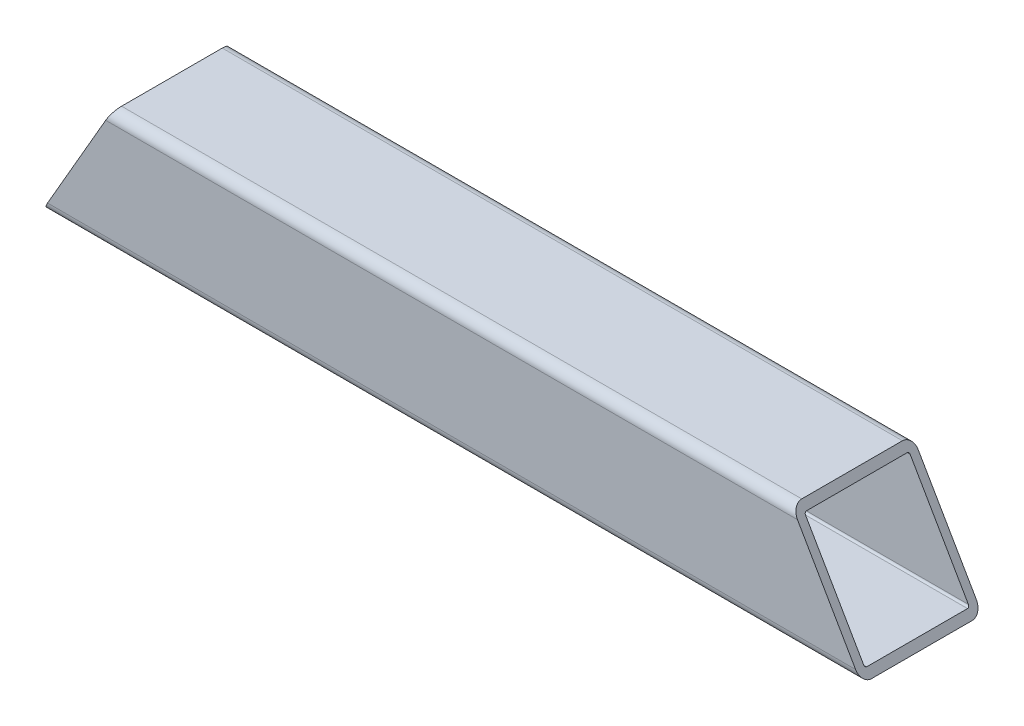
ISO-10303-21;
HEADER;
FILE_DESCRIPTION(('STEP AP214'),'2;1');
FILE_NAME('part.step','',(''),(''),'','','');
FILE_SCHEMA(('AUTOMOTIVE_DESIGN { 1 0 10303 214 1 1 1 1 }'));
ENDSEC;
DATA;
#1=APPLICATION_CONTEXT('core data for automotive mechanical design processes');
#2=APPLICATION_PROTOCOL_DEFINITION('international standard','automotive_design',2000,#1);
#3=PRODUCT_CONTEXT('',#1,'mechanical');
#4=PRODUCT('Part','Part','',(#3));
#5=PRODUCT_RELATED_PRODUCT_CATEGORY('part','',(#4));
#6=PRODUCT_DEFINITION_FORMATION('','',#4);
#7=PRODUCT_DEFINITION_CONTEXT('part definition',#1,'design');
#8=PRODUCT_DEFINITION('design','',#6,#7);
#9=PRODUCT_DEFINITION_SHAPE('','',#8);
#10=(LENGTH_UNIT() NAMED_UNIT(*) SI_UNIT(.MILLI.,.METRE.));
#11=(NAMED_UNIT(*) PLANE_ANGLE_UNIT() SI_UNIT($,.RADIAN.));
#12=(NAMED_UNIT(*) SI_UNIT($,.STERADIAN.) SOLID_ANGLE_UNIT());
#13=UNCERTAINTY_MEASURE_WITH_UNIT(LENGTH_MEASURE(1.E-05),#10,'distance_accuracy_value','');
#14=(GEOMETRIC_REPRESENTATION_CONTEXT(3) GLOBAL_UNCERTAINTY_ASSIGNED_CONTEXT((#13)) GLOBAL_UNIT_ASSIGNED_CONTEXT((#10,
#11,#12)) REPRESENTATION_CONTEXT('',''));
#15=CARTESIAN_POINT('',(0.,0.,0.));
#16=DIRECTION('',(0.,0.,1.));
#17=DIRECTION('',(1.,0.,0.));
#18=AXIS2_PLACEMENT_3D('',#15,#16,#17);
#19=CARTESIAN_POINT('',(129.2225,-15.875,15.875));
#20=DIRECTION('',(-1.,0.,0.));
#21=DIRECTION('',(0.,0.,1.));
#22=AXIS2_PLACEMENT_3D('',#19,#20,#21);
#23=CYLINDRICAL_SURFACE('',#22,3.175);
#24=DIRECTION('',(-1.,0.,0.));
#25=VECTOR('',#24,1.);
#26=CARTESIAN_POINT('',(129.2225,-19.05,15.875));
#27=LINE('',#26,#25);
#28=CARTESIAN_POINT('',(129.2225,-19.05,15.875));
#29=VERTEX_POINT('',#28);
#30=CARTESIAN_POINT('',(-129.2225,-19.05,15.875));
#31=VERTEX_POINT('',#30);
#32=EDGE_CURVE('E88',#29,#31,#27,.T.);
#33=ORIENTED_EDGE('',*,*,#32,.F.);
#34=CARTESIAN_POINT('',(127.389412895323,-15.875,15.875));
#35=DIRECTION('',(-0.866025403784442,-0.499999999999995,0.));
#36=DIRECTION('',(-0.499999999999995,0.866025403784442,0.));
#37=AXIS2_PLACEMENT_3D('',#34,#35,#36);
#38=ELLIPSE('',#37,3.66617420935411,3.175);
#39=CARTESIAN_POINT('',(127.389412895323,-15.875,19.05));
#40=VERTEX_POINT('',#39);
#41=EDGE_CURVE('E216',#29,#40,#38,.T.);
#42=ORIENTED_EDGE('',*,*,#41,.T.);
#43=DIRECTION('',(-1.,0.,0.));
#44=VECTOR('',#43,1.);
#45=CARTESIAN_POINT('',(129.2225,-15.875,19.05));
#46=LINE('',#45,#44);
#47=CARTESIAN_POINT('',(-127.389412895323,-15.875,19.05));
#48=VERTEX_POINT('',#47);
#49=EDGE_CURVE('E217',#40,#48,#46,.T.);
#50=ORIENTED_EDGE('',*,*,#49,.T.);
#51=CARTESIAN_POINT('',(-127.389412895323,-15.875,15.875));
#52=DIRECTION('',(-0.866025403784442,0.499999999999995,0.));
#53=DIRECTION('',(-0.499999999999995,-0.866025403784442,0.));
#54=AXIS2_PLACEMENT_3D('',#51,#52,#53);
#55=ELLIPSE('',#54,3.66617420935411,3.175);
#56=EDGE_CURVE('E239',#31,#48,#55,.T.);
#57=ORIENTED_EDGE('',*,*,#56,.F.);
#58=EDGE_LOOP('',(#33,#42,#50,#57));
#59=FACE_BOUND('',#58,.T.);
#60=ADVANCED_FACE('F81',(#59),#23,.T.);
#61=CARTESIAN_POINT('',(129.2225,-15.875,-15.875));
#62=DIRECTION('',(-1.,0.,0.));
#63=DIRECTION('',(0.,0.,1.));
#64=AXIS2_PLACEMENT_3D('',#61,#62,#63);
#65=CYLINDRICAL_SURFACE('',#64,3.175);
#66=DIRECTION('',(-1.,0.,0.));
#67=VECTOR('',#66,1.);
#68=CARTESIAN_POINT('',(129.2225,-15.875,-19.05));
#69=LINE('',#68,#67);
#70=CARTESIAN_POINT('',(127.389412895323,-15.875,-19.05));
#71=VERTEX_POINT('',#70);
#72=CARTESIAN_POINT('',(-127.389412895323,-15.875,-19.05));
#73=VERTEX_POINT('',#72);
#74=EDGE_CURVE('E205',#71,#73,#69,.T.);
#75=ORIENTED_EDGE('',*,*,#74,.F.);
#76=CARTESIAN_POINT('',(127.389412895323,-15.875,-15.875));
#77=DIRECTION('',(-0.866025403784442,-0.499999999999995,0.));
#78=DIRECTION('',(-0.499999999999995,0.866025403784442,0.));
#79=AXIS2_PLACEMENT_3D('',#76,#77,#78);
#80=ELLIPSE('',#79,3.66617420935411,3.175);
#81=CARTESIAN_POINT('',(129.2225,-19.05,-15.875));
#82=VERTEX_POINT('',#81);
#83=EDGE_CURVE('E208',#71,#82,#80,.T.);
#84=ORIENTED_EDGE('',*,*,#83,.T.);
#85=DIRECTION('',(-1.,0.,0.));
#86=VECTOR('',#85,1.);
#87=CARTESIAN_POINT('',(129.2225,-19.05,-15.875));
#88=LINE('',#87,#86);
#89=CARTESIAN_POINT('',(-129.2225,-19.05,-15.875));
#90=VERTEX_POINT('',#89);
#91=EDGE_CURVE('E193',#82,#90,#88,.T.);
#92=ORIENTED_EDGE('',*,*,#91,.T.);
#93=CARTESIAN_POINT('',(-127.389412895323,-15.875,-15.875));
#94=DIRECTION('',(-0.866025403784442,0.499999999999995,0.));
#95=DIRECTION('',(-0.499999999999995,-0.866025403784442,0.));
#96=AXIS2_PLACEMENT_3D('',#93,#94,#95);
#97=ELLIPSE('',#96,3.66617420935411,3.175);
#98=EDGE_CURVE('E240',#73,#90,#97,.T.);
#99=ORIENTED_EDGE('',*,*,#98,.F.);
#100=EDGE_LOOP('',(#75,#84,#92,#99));
#101=FACE_BOUND('',#100,.T.);
#102=ADVANCED_FACE('F209',(#101),#65,.T.);
#103=CARTESIAN_POINT('',(129.2225,15.875,-19.05));
#104=DIRECTION('',(0.,0.,1.));
#105=DIRECTION('',(0.,-1.,0.));
#106=AXIS2_PLACEMENT_3D('',#103,#104,#105);
#107=PLANE('',#106);
#108=DIRECTION('',(-1.,0.,0.));
#109=VECTOR('',#108,1.);
#110=CARTESIAN_POINT('',(129.2225,15.875,-19.05));
#111=LINE('',#110,#109);
#112=CARTESIAN_POINT('',(109.058541848553,15.875,-19.05));
#113=VERTEX_POINT('',#112);
#114=CARTESIAN_POINT('',(-109.058541848553,15.875,-19.05));
#115=VERTEX_POINT('',#114);
#116=EDGE_CURVE('E231',#113,#115,#111,.T.);
#117=ORIENTED_EDGE('',*,*,#116,.F.);
#118=DIRECTION('',(0.499999999999995,-0.866025403784442,0.));
#119=VECTOR('',#118,1.);
#120=CARTESIAN_POINT('',(114.099531386414,7.14375000000017,-19.05));
#121=LINE('',#120,#119);
#122=EDGE_CURVE('E95',#113,#71,#121,.T.);
#123=ORIENTED_EDGE('',*,*,#122,.T.);
#124=ORIENTED_EDGE('',*,*,#74,.T.);
#125=DIRECTION('',(-0.499999999999995,-0.866025403784442,0.));
#126=VECTOR('',#125,1.);
#127=CARTESIAN_POINT('',(-49.4882813864157,119.053717740534,-19.05));
#128=LINE('',#127,#126);
#129=EDGE_CURVE('E243',#115,#73,#128,.T.);
#130=ORIENTED_EDGE('',*,*,#129,.F.);
#131=EDGE_LOOP('',(#117,#123,#124,#130));
#132=FACE_BOUND('',#131,.T.);
#133=ADVANCED_FACE('F298',(#132),#107,.F.);
#134=CARTESIAN_POINT('',(129.2225,15.875,-15.875));
#135=DIRECTION('',(-1.,0.,0.));
#136=DIRECTION('',(0.,0.,1.));
#137=AXIS2_PLACEMENT_3D('',#134,#135,#136);
#138=CYLINDRICAL_SURFACE('',#137,3.175);
#139=DIRECTION('',(-1.,0.,0.));
#140=VECTOR('',#139,1.);
#141=CARTESIAN_POINT('',(129.2225,19.05,-15.875));
#142=LINE('',#141,#140);
#143=CARTESIAN_POINT('',(107.225454743876,19.05,-15.875));
#144=VERTEX_POINT('',#143);
#145=CARTESIAN_POINT('',(-107.225454743876,19.05,-15.875));
#146=VERTEX_POINT('',#145);
#147=EDGE_CURVE('E229',#144,#146,#142,.T.);
#148=ORIENTED_EDGE('',*,*,#147,.F.);
#149=CARTESIAN_POINT('',(109.058541848553,15.875,-15.875));
#150=DIRECTION('',(-0.866025403784442,-0.499999999999995,0.));
#151=DIRECTION('',(-0.499999999999995,0.866025403784442,0.));
#152=AXIS2_PLACEMENT_3D('',#149,#150,#151);
#153=ELLIPSE('',#152,3.66617420935412,3.175);
#154=EDGE_CURVE('E103',#144,#113,#153,.T.);
#155=ORIENTED_EDGE('',*,*,#154,.T.);
#156=ORIENTED_EDGE('',*,*,#116,.T.);
#157=CARTESIAN_POINT('',(-109.058541848553,15.875,-15.875));
#158=DIRECTION('',(-0.866025403784442,0.499999999999995,0.));
#159=DIRECTION('',(-0.499999999999995,-0.866025403784442,0.));
#160=AXIS2_PLACEMENT_3D('',#157,#158,#159);
#161=ELLIPSE('',#160,3.66617420935412,3.175);
#162=EDGE_CURVE('E248',#146,#115,#161,.T.);
#163=ORIENTED_EDGE('',*,*,#162,.F.);
#164=EDGE_LOOP('',(#148,#155,#156,#163));
#165=FACE_BOUND('',#164,.T.);
#166=ADVANCED_FACE('F297',(#165),#138,.T.);
#167=CARTESIAN_POINT('',(129.2225,19.05,15.875));
#168=DIRECTION('',(0.,-1.,0.));
#169=DIRECTION('',(0.,0.,-1.));
#170=AXIS2_PLACEMENT_3D('',#167,#168,#169);
#171=PLANE('',#170);
#172=DIRECTION('',(-1.,0.,0.));
#173=VECTOR('',#172,1.);
#174=CARTESIAN_POINT('',(129.2225,19.05,15.875));
#175=LINE('',#174,#173);
#176=CARTESIAN_POINT('',(107.225454743876,19.05,15.875));
#177=VERTEX_POINT('',#176);
#178=CARTESIAN_POINT('',(-107.225454743876,19.05,15.875));
#179=VERTEX_POINT('',#178);
#180=EDGE_CURVE('E227',#177,#179,#175,.T.);
#181=ORIENTED_EDGE('',*,*,#180,.F.);
#182=DIRECTION('',(0.,0.,-1.));
#183=VECTOR('',#182,1.);
#184=CARTESIAN_POINT('',(107.225454743876,19.05,353.021207436399));
#185=LINE('',#184,#183);
#186=EDGE_CURVE('E508',#177,#144,#185,.T.);
#187=ORIENTED_EDGE('',*,*,#186,.T.);
#188=ORIENTED_EDGE('',*,*,#147,.T.);
#189=DIRECTION('',(0.,0.,-1.));
#190=VECTOR('',#189,1.);
#191=CARTESIAN_POINT('',(-107.225454743876,19.05,353.021207436399));
#192=LINE('',#191,#190);
#193=EDGE_CURVE('E211',#179,#146,#192,.T.);
#194=ORIENTED_EDGE('',*,*,#193,.F.);
#195=EDGE_LOOP('',(#181,#187,#188,#194));
#196=FACE_BOUND('',#195,.T.);
#197=ADVANCED_FACE('F305',(#196),#171,.F.);
#198=CARTESIAN_POINT('',(129.2225,15.875,15.875));
#199=DIRECTION('',(-1.,0.,0.));
#200=DIRECTION('',(0.,0.,1.));
#201=AXIS2_PLACEMENT_3D('',#198,#199,#200);
#202=CYLINDRICAL_SURFACE('',#201,3.175);
#203=DIRECTION('',(-1.,0.,0.));
#204=VECTOR('',#203,1.);
#205=CARTESIAN_POINT('',(129.2225,15.875,19.05));
#206=LINE('',#205,#204);
#207=CARTESIAN_POINT('',(109.058541848553,15.875,19.05));
#208=VERTEX_POINT('',#207);
#209=CARTESIAN_POINT('',(-109.058541848553,15.875,19.05));
#210=VERTEX_POINT('',#209);
#211=EDGE_CURVE('E219',#208,#210,#206,.T.);
#212=ORIENTED_EDGE('',*,*,#211,.F.);
#213=CARTESIAN_POINT('',(109.058541848553,15.875,15.875));
#214=DIRECTION('',(-0.866025403784442,-0.499999999999995,0.));
#215=DIRECTION('',(-0.499999999999995,0.866025403784442,0.));
#216=AXIS2_PLACEMENT_3D('',#213,#214,#215);
#217=ELLIPSE('',#216,3.66617420935412,3.175);
#218=EDGE_CURVE('E473',#208,#177,#217,.T.);
#219=ORIENTED_EDGE('',*,*,#218,.T.);
#220=ORIENTED_EDGE('',*,*,#180,.T.);
#221=CARTESIAN_POINT('',(-109.058541848553,15.875,15.875));
#222=DIRECTION('',(-0.866025403784442,0.499999999999995,0.));
#223=DIRECTION('',(-0.499999999999995,-0.866025403784442,0.));
#224=AXIS2_PLACEMENT_3D('',#221,#222,#223);
#225=ELLIPSE('',#224,3.66617420935412,3.175);
#226=EDGE_CURVE('E291',#210,#179,#225,.T.);
#227=ORIENTED_EDGE('',*,*,#226,.F.);
#228=EDGE_LOOP('',(#212,#219,#220,#227));
#229=FACE_BOUND('',#228,.T.);
#230=ADVANCED_FACE('F335',(#229),#202,.T.);
#231=CARTESIAN_POINT('',(129.2225,15.875,19.05));
#232=DIRECTION('',(0.,0.,-1.));
#233=DIRECTION('',(0.,1.,0.));
#234=AXIS2_PLACEMENT_3D('',#231,#232,#233);
#235=PLANE('',#234);
#236=ORIENTED_EDGE('',*,*,#49,.F.);
#237=DIRECTION('',(-0.499999999999995,0.866025403784442,0.));
#238=VECTOR('',#237,1.);
#239=CARTESIAN_POINT('',(114.099531386414,7.14375000000017,19.05));
#240=LINE('',#239,#238);
#241=EDGE_CURVE('E466',#40,#208,#240,.T.);
#242=ORIENTED_EDGE('',*,*,#241,.T.);
#243=ORIENTED_EDGE('',*,*,#211,.T.);
#244=DIRECTION('',(0.499999999999995,0.866025403784442,0.));
#245=VECTOR('',#244,1.);
#246=CARTESIAN_POINT('',(-49.4882813864157,119.053717740534,19.05));
#247=LINE('',#246,#245);
#248=EDGE_CURVE('E281',#48,#210,#247,.T.);
#249=ORIENTED_EDGE('',*,*,#248,.F.);
#250=EDGE_LOOP('',(#236,#242,#243,#249));
#251=FACE_BOUND('',#250,.T.);
#252=ADVANCED_FACE('F345',(#251),#235,.F.);
#253=CARTESIAN_POINT('',(129.2225,-15.875,15.875));
#254=DIRECTION('',(-1.,0.,0.));
#255=DIRECTION('',(0.,0.,1.));
#256=AXIS2_PLACEMENT_3D('',#253,#254,#255);
#257=CYLINDRICAL_SURFACE('',#256,0.635000000000002);
#258=CARTESIAN_POINT('',(127.389412895323,-15.875,15.875));
#259=DIRECTION('',(-0.866025403784442,-0.499999999999995,0.));
#260=DIRECTION('',(-0.499999999999995,0.866025403784442,0.));
#261=AXIS2_PLACEMENT_3D('',#258,#259,#260);
#262=ELLIPSE('',#261,0.733234841870825,0.635000000000002);
#263=CARTESIAN_POINT('',(127.756030316258,-16.51,15.875));
#264=VERTEX_POINT('',#263);
#265=CARTESIAN_POINT('',(127.389412895323,-15.875,16.51));
#266=VERTEX_POINT('',#265);
#267=EDGE_CURVE('E273',#264,#266,#262,.T.);
#268=ORIENTED_EDGE('',*,*,#267,.F.);
#269=DIRECTION('',(-1.,0.,0.));
#270=VECTOR('',#269,1.);
#271=CARTESIAN_POINT('',(129.2225,-16.51,15.875));
#272=LINE('',#271,#270);
#273=CARTESIAN_POINT('',(-127.756030316258,-16.51,15.875));
#274=VERTEX_POINT('',#273);
#275=EDGE_CURVE('E221',#264,#274,#272,.T.);
#276=ORIENTED_EDGE('',*,*,#275,.T.);
#277=CARTESIAN_POINT('',(-127.389412895323,-15.875,15.875));
#278=DIRECTION('',(-0.866025403784442,0.499999999999995,0.));
#279=DIRECTION('',(-0.499999999999995,-0.866025403784442,0.));
#280=AXIS2_PLACEMENT_3D('',#277,#278,#279);
#281=ELLIPSE('',#280,0.733234841870825,0.635000000000002);
#282=CARTESIAN_POINT('',(-127.389412895323,-15.875,16.51));
#283=VERTEX_POINT('',#282);
#284=EDGE_CURVE('E271',#274,#283,#281,.T.);
#285=ORIENTED_EDGE('',*,*,#284,.T.);
#286=DIRECTION('',(-1.,0.,0.));
#287=VECTOR('',#286,1.);
#288=CARTESIAN_POINT('',(129.2225,-15.875,16.51));
#289=LINE('',#288,#287);
#290=EDGE_CURVE('E244',#266,#283,#289,.T.);
#291=ORIENTED_EDGE('',*,*,#290,.F.);
#292=EDGE_LOOP('',(#268,#276,#285,#291));
#293=FACE_BOUND('',#292,.T.);
#294=ADVANCED_FACE('F269',(#293),#257,.F.);
#295=CARTESIAN_POINT('',(129.2225,-16.51,15.875));
#296=DIRECTION('',(0.,1.,0.));
#297=DIRECTION('',(0.,0.,1.));
#298=AXIS2_PLACEMENT_3D('',#295,#296,#297);
#299=PLANE('',#298);
#300=DIRECTION('',(0.,0.,1.));
#301=VECTOR('',#300,1.);
#302=CARTESIAN_POINT('',(127.756030316258,-16.51,15.875));
#303=LINE('',#302,#301);
#304=CARTESIAN_POINT('',(127.756030316258,-16.51,-15.875));
#305=VERTEX_POINT('',#304);
#306=EDGE_CURVE('E461',#305,#264,#303,.T.);
#307=ORIENTED_EDGE('',*,*,#306,.F.);
#308=DIRECTION('',(-1.,0.,0.));
#309=VECTOR('',#308,1.);
#310=CARTESIAN_POINT('',(129.2225,-16.51,-15.875));
#311=LINE('',#310,#309);
#312=CARTESIAN_POINT('',(-127.756030316258,-16.51,-15.875));
#313=VERTEX_POINT('',#312);
#314=EDGE_CURVE('E260',#305,#313,#311,.T.);
#315=ORIENTED_EDGE('',*,*,#314,.T.);
#316=DIRECTION('',(0.,0.,1.));
#317=VECTOR('',#316,1.);
#318=CARTESIAN_POINT('',(-127.756030316258,-16.51,15.875));
#319=LINE('',#318,#317);
#320=EDGE_CURVE('E278',#313,#274,#319,.T.);
#321=ORIENTED_EDGE('',*,*,#320,.T.);
#322=ORIENTED_EDGE('',*,*,#275,.F.);
#323=EDGE_LOOP('',(#307,#315,#321,#322));
#324=FACE_BOUND('',#323,.T.);
#325=ADVANCED_FACE('F283',(#324),#299,.T.);
#326=CARTESIAN_POINT('',(129.2225,-15.875,-15.875));
#327=DIRECTION('',(-1.,0.,0.));
#328=DIRECTION('',(0.,0.,1.));
#329=AXIS2_PLACEMENT_3D('',#326,#327,#328);
#330=CYLINDRICAL_SURFACE('',#329,0.634999999999999);
#331=CARTESIAN_POINT('',(127.389412895323,-15.875,-15.875));
#332=DIRECTION('',(-0.866025403784442,-0.499999999999995,0.));
#333=DIRECTION('',(-0.499999999999995,0.866025403784442,0.));
#334=AXIS2_PLACEMENT_3D('',#331,#332,#333);
#335=ELLIPSE('',#334,0.733234841870821,0.634999999999999);
#336=CARTESIAN_POINT('',(127.389412895323,-15.875,-16.51));
#337=VERTEX_POINT('',#336);
#338=EDGE_CURVE('E464',#337,#305,#335,.T.);
#339=ORIENTED_EDGE('',*,*,#338,.F.);
#340=DIRECTION('',(-1.,0.,0.));
#341=VECTOR('',#340,1.);
#342=CARTESIAN_POINT('',(129.2225,-15.875,-16.51));
#343=LINE('',#342,#341);
#344=CARTESIAN_POINT('',(-127.389412895323,-15.875,-16.51));
#345=VERTEX_POINT('',#344);
#346=EDGE_CURVE('E259',#337,#345,#343,.T.);
#347=ORIENTED_EDGE('',*,*,#346,.T.);
#348=CARTESIAN_POINT('',(-127.389412895323,-15.875,-15.875));
#349=DIRECTION('',(-0.866025403784442,0.499999999999995,0.));
#350=DIRECTION('',(-0.499999999999995,-0.866025403784442,0.));
#351=AXIS2_PLACEMENT_3D('',#348,#349,#350);
#352=ELLIPSE('',#351,0.733234841870821,0.634999999999999);
#353=EDGE_CURVE('E284',#345,#313,#352,.T.);
#354=ORIENTED_EDGE('',*,*,#353,.T.);
#355=ORIENTED_EDGE('',*,*,#314,.F.);
#356=EDGE_LOOP('',(#339,#347,#354,#355));
#357=FACE_BOUND('',#356,.T.);
#358=ADVANCED_FACE('F372',(#357),#330,.F.);
#359=CARTESIAN_POINT('',(129.2225,15.875,-16.51));
#360=DIRECTION('',(0.,0.,1.));
#361=DIRECTION('',(0.,-1.,0.));
#362=AXIS2_PLACEMENT_3D('',#359,#360,#361);
#363=PLANE('',#362);
#364=DIRECTION('',(0.499999999999995,-0.866025403784442,0.));
#365=VECTOR('',#364,1.);
#366=CARTESIAN_POINT('',(114.099531386414,7.14375000000017,-16.51));
#367=LINE('',#366,#365);
#368=CARTESIAN_POINT('',(109.058541848553,15.875,-16.51));
#369=VERTEX_POINT('',#368);
#370=EDGE_CURVE('E468',#369,#337,#367,.T.);
#371=ORIENTED_EDGE('',*,*,#370,.F.);
#372=DIRECTION('',(-1.,0.,0.));
#373=VECTOR('',#372,1.);
#374=CARTESIAN_POINT('',(129.2225,15.875,-16.51));
#375=LINE('',#374,#373);
#376=CARTESIAN_POINT('',(-109.058541848553,15.875,-16.51));
#377=VERTEX_POINT('',#376);
#378=EDGE_CURVE('E257',#369,#377,#375,.T.);
#379=ORIENTED_EDGE('',*,*,#378,.T.);
#380=DIRECTION('',(-0.499999999999995,-0.866025403784442,0.));
#381=VECTOR('',#380,1.);
#382=CARTESIAN_POINT('',(-49.4882813864157,119.053717740534,-16.51));
#383=LINE('',#382,#381);
#384=EDGE_CURVE('E286',#377,#345,#383,.T.);
#385=ORIENTED_EDGE('',*,*,#384,.T.);
#386=ORIENTED_EDGE('',*,*,#346,.F.);
#387=EDGE_LOOP('',(#371,#379,#385,#386));
#388=FACE_BOUND('',#387,.T.);
#389=ADVANCED_FACE('F381',(#388),#363,.T.);
#390=CARTESIAN_POINT('',(129.2225,15.875,-15.875));
#391=DIRECTION('',(-1.,0.,0.));
#392=DIRECTION('',(0.,0.,1.));
#393=AXIS2_PLACEMENT_3D('',#390,#391,#392);
#394=CYLINDRICAL_SURFACE('',#393,0.635000000000004);
#395=CARTESIAN_POINT('',(109.058541848553,15.875,-15.875));
#396=DIRECTION('',(-0.866025403784442,-0.499999999999995,0.));
#397=DIRECTION('',(-0.499999999999995,0.866025403784442,0.));
#398=AXIS2_PLACEMENT_3D('',#395,#396,#397);
#399=ELLIPSE('',#398,0.733234841870827,0.635000000000004);
#400=CARTESIAN_POINT('',(108.691924427617,16.51,-15.875));
#401=VERTEX_POINT('',#400);
#402=EDGE_CURVE('E495',#401,#369,#399,.T.);
#403=ORIENTED_EDGE('',*,*,#402,.F.);
#404=DIRECTION('',(-1.,0.,0.));
#405=VECTOR('',#404,1.);
#406=CARTESIAN_POINT('',(129.2225,16.51,-15.875));
#407=LINE('',#406,#405);
#408=CARTESIAN_POINT('',(-108.691924427617,16.51,-15.875));
#409=VERTEX_POINT('',#408);
#410=EDGE_CURVE('E255',#401,#409,#407,.T.);
#411=ORIENTED_EDGE('',*,*,#410,.T.);
#412=CARTESIAN_POINT('',(-109.058541848553,15.875,-15.875));
#413=DIRECTION('',(-0.866025403784442,0.499999999999995,0.));
#414=DIRECTION('',(-0.499999999999995,-0.866025403784442,0.));
#415=AXIS2_PLACEMENT_3D('',#412,#413,#414);
#416=ELLIPSE('',#415,0.733234841870827,0.635000000000004);
#417=EDGE_CURVE('E485',#409,#377,#416,.T.);
#418=ORIENTED_EDGE('',*,*,#417,.T.);
#419=ORIENTED_EDGE('',*,*,#378,.F.);
#420=EDGE_LOOP('',(#403,#411,#418,#419));
#421=FACE_BOUND('',#420,.T.);
#422=ADVANCED_FACE('F391',(#421),#394,.F.);
#423=CARTESIAN_POINT('',(129.2225,16.51,15.875));
#424=DIRECTION('',(0.,-1.,0.));
#425=DIRECTION('',(0.,0.,-1.));
#426=AXIS2_PLACEMENT_3D('',#423,#424,#425);
#427=PLANE('',#426);
#428=DIRECTION('',(0.,0.,-1.));
#429=VECTOR('',#428,1.);
#430=CARTESIAN_POINT('',(108.691924427617,16.51,15.875));
#431=LINE('',#430,#429);
#432=CARTESIAN_POINT('',(108.691924427617,16.51,15.875));
#433=VERTEX_POINT('',#432);
#434=EDGE_CURVE('E497',#433,#401,#431,.T.);
#435=ORIENTED_EDGE('',*,*,#434,.F.);
#436=DIRECTION('',(-1.,0.,0.));
#437=VECTOR('',#436,1.);
#438=CARTESIAN_POINT('',(129.2225,16.51,15.875));
#439=LINE('',#438,#437);
#440=CARTESIAN_POINT('',(-108.691924427617,16.51,15.875));
#441=VERTEX_POINT('',#440);
#442=EDGE_CURVE('E253',#433,#441,#439,.T.);
#443=ORIENTED_EDGE('',*,*,#442,.T.);
#444=DIRECTION('',(0.,0.,-1.));
#445=VECTOR('',#444,1.);
#446=CARTESIAN_POINT('',(-108.691924427617,16.51,15.875));
#447=LINE('',#446,#445);
#448=EDGE_CURVE('E482',#441,#409,#447,.T.);
#449=ORIENTED_EDGE('',*,*,#448,.T.);
#450=ORIENTED_EDGE('',*,*,#410,.F.);
#451=EDGE_LOOP('',(#435,#443,#449,#450));
#452=FACE_BOUND('',#451,.T.);
#453=ADVANCED_FACE('F401',(#452),#427,.T.);
#454=CARTESIAN_POINT('',(129.2225,15.875,15.875));
#455=DIRECTION('',(-1.,0.,0.));
#456=DIRECTION('',(0.,0.,1.));
#457=AXIS2_PLACEMENT_3D('',#454,#455,#456);
#458=CYLINDRICAL_SURFACE('',#457,0.635000000000004);
#459=CARTESIAN_POINT('',(109.058541848553,15.875,15.875));
#460=DIRECTION('',(-0.866025403784442,-0.499999999999995,0.));
#461=DIRECTION('',(-0.499999999999995,0.866025403784442,0.));
#462=AXIS2_PLACEMENT_3D('',#459,#460,#461);
#463=ELLIPSE('',#462,0.733234841870827,0.635000000000004);
#464=CARTESIAN_POINT('',(109.058541848553,15.875,16.51));
#465=VERTEX_POINT('',#464);
#466=EDGE_CURVE('E501',#465,#433,#463,.T.);
#467=ORIENTED_EDGE('',*,*,#466,.F.);
#468=DIRECTION('',(-1.,0.,0.));
#469=VECTOR('',#468,1.);
#470=CARTESIAN_POINT('',(129.2225,15.875,16.51));
#471=LINE('',#470,#469);
#472=CARTESIAN_POINT('',(-109.058541848553,15.875,16.51));
#473=VERTEX_POINT('',#472);
#474=EDGE_CURVE('E246',#465,#473,#471,.T.);
#475=ORIENTED_EDGE('',*,*,#474,.T.);
#476=CARTESIAN_POINT('',(-109.058541848553,15.875,15.875));
#477=DIRECTION('',(-0.866025403784442,0.499999999999995,0.));
#478=DIRECTION('',(-0.499999999999995,-0.866025403784442,0.));
#479=AXIS2_PLACEMENT_3D('',#476,#477,#478);
#480=ELLIPSE('',#479,0.733234841870827,0.635000000000004);
#481=EDGE_CURVE('E479',#473,#441,#480,.T.);
#482=ORIENTED_EDGE('',*,*,#481,.T.);
#483=ORIENTED_EDGE('',*,*,#442,.F.);
#484=EDGE_LOOP('',(#467,#475,#482,#483));
#485=FACE_BOUND('',#484,.T.);
#486=ADVANCED_FACE('F411',(#485),#458,.F.);
#487=CARTESIAN_POINT('',(129.2225,15.875,16.51));
#488=DIRECTION('',(0.,0.,-1.));
#489=DIRECTION('',(0.,1.,0.));
#490=AXIS2_PLACEMENT_3D('',#487,#488,#489);
#491=PLANE('',#490);
#492=DIRECTION('',(-0.499999999999995,0.866025403784442,0.));
#493=VECTOR('',#492,1.);
#494=CARTESIAN_POINT('',(114.099531386414,7.14375000000017,16.51));
#495=LINE('',#494,#493);
#496=EDGE_CURVE('E504',#266,#465,#495,.T.);
#497=ORIENTED_EDGE('',*,*,#496,.F.);
#498=ORIENTED_EDGE('',*,*,#290,.T.);
#499=DIRECTION('',(0.499999999999995,0.866025403784442,0.));
#500=VECTOR('',#499,1.);
#501=CARTESIAN_POINT('',(-49.4882813864157,119.053717740534,16.51));
#502=LINE('',#501,#500);
#503=EDGE_CURVE('E12',#283,#473,#502,.T.);
#504=ORIENTED_EDGE('',*,*,#503,.T.);
#505=ORIENTED_EDGE('',*,*,#474,.F.);
#506=EDGE_LOOP('',(#497,#498,#504,#505));
#507=FACE_BOUND('',#506,.T.);
#508=ADVANCED_FACE('F421',(#507),#491,.T.);
#509=CARTESIAN_POINT('',(129.2225,-19.05,15.875));
#510=DIRECTION('',(0.,1.,0.));
#511=DIRECTION('',(0.,0.,1.));
#512=AXIS2_PLACEMENT_3D('',#509,#510,#511);
#513=PLANE('',#512);
#514=DIRECTION('',(0.,0.,-1.));
#515=VECTOR('',#514,1.);
#516=CARTESIAN_POINT('',(-129.2225,-19.05,15.875));
#517=LINE('',#516,#515);
#518=EDGE_CURVE('E201',#31,#90,#517,.T.);
#519=ORIENTED_EDGE('',*,*,#518,.T.);
#520=ORIENTED_EDGE('',*,*,#91,.F.);
#521=DIRECTION('',(0.,0.,-1.));
#522=VECTOR('',#521,1.);
#523=CARTESIAN_POINT('',(129.2225,-19.05,15.875));
#524=LINE('',#523,#522);
#525=EDGE_CURVE('E198',#29,#82,#524,.T.);
#526=ORIENTED_EDGE('',*,*,#525,.F.);
#527=ORIENTED_EDGE('',*,*,#32,.T.);
#528=EDGE_LOOP('',(#519,#520,#526,#527));
#529=FACE_BOUND('',#528,.T.);
#530=ADVANCED_FACE('F195',(#529),#513,.F.);
#531=CARTESIAN_POINT('',(-129.2225,-19.05,353.021207436399));
#532=DIRECTION('',(-0.866025403784442,0.499999999999995,0.));
#533=DIRECTION('',(-0.499999999999995,-0.866025403784442,0.));
#534=AXIS2_PLACEMENT_3D('',#531,#532,#533);
#535=PLANE('',#534);
#536=ORIENTED_EDGE('',*,*,#284,.F.);
#537=ORIENTED_EDGE('',*,*,#320,.F.);
#538=ORIENTED_EDGE('',*,*,#353,.F.);
#539=ORIENTED_EDGE('',*,*,#384,.F.);
#540=ORIENTED_EDGE('',*,*,#417,.F.);
#541=ORIENTED_EDGE('',*,*,#448,.F.);
#542=ORIENTED_EDGE('',*,*,#481,.F.);
#543=ORIENTED_EDGE('',*,*,#503,.F.);
#544=EDGE_LOOP('',(#536,#537,#538,#539,#540,#541,#542,#543));
#545=FACE_BOUND('',#544,.T.);
#546=ORIENTED_EDGE('',*,*,#129,.T.);
#547=ORIENTED_EDGE('',*,*,#98,.T.);
#548=ORIENTED_EDGE('',*,*,#518,.F.);
#549=ORIENTED_EDGE('',*,*,#56,.T.);
#550=ORIENTED_EDGE('',*,*,#248,.T.);
#551=ORIENTED_EDGE('',*,*,#226,.T.);
#552=ORIENTED_EDGE('',*,*,#193,.T.);
#553=ORIENTED_EDGE('',*,*,#162,.T.);
#554=EDGE_LOOP('',(#546,#547,#548,#549,#550,#551,#552,#553));
#555=FACE_BOUND('',#554,.T.);
#556=ADVANCED_FACE('F237',(#545,#555),#535,.T.);
#557=CARTESIAN_POINT('',(129.2225,-19.05,353.021207436399));
#558=DIRECTION('',(-0.866025403784442,-0.499999999999995,0.));
#559=DIRECTION('',(0.499999999999995,-0.866025403784442,0.));
#560=AXIS2_PLACEMENT_3D('',#557,#558,#559);
#561=PLANE('',#560);
#562=ORIENTED_EDGE('',*,*,#306,.T.);
#563=ORIENTED_EDGE('',*,*,#267,.T.);
#564=ORIENTED_EDGE('',*,*,#496,.T.);
#565=ORIENTED_EDGE('',*,*,#466,.T.);
#566=ORIENTED_EDGE('',*,*,#434,.T.);
#567=ORIENTED_EDGE('',*,*,#402,.T.);
#568=ORIENTED_EDGE('',*,*,#370,.T.);
#569=ORIENTED_EDGE('',*,*,#338,.T.);
#570=EDGE_LOOP('',(#562,#563,#564,#565,#566,#567,#568,#569));
#571=FACE_BOUND('',#570,.T.);
#572=ORIENTED_EDGE('',*,*,#83,.F.);
#573=ORIENTED_EDGE('',*,*,#122,.F.);
#574=ORIENTED_EDGE('',*,*,#154,.F.);
#575=ORIENTED_EDGE('',*,*,#186,.F.);
#576=ORIENTED_EDGE('',*,*,#218,.F.);
#577=ORIENTED_EDGE('',*,*,#241,.F.);
#578=ORIENTED_EDGE('',*,*,#41,.F.);
#579=ORIENTED_EDGE('',*,*,#525,.T.);
#580=EDGE_LOOP('',(#572,#573,#574,#575,#576,#577,#578,#579));
#581=FACE_BOUND('',#580,.T.);
#582=ADVANCED_FACE('F214',(#571,#581),#561,.F.);
#583=CLOSED_SHELL('',(#60,#102,#133,#166,#197,#230,#252,#294,#325,#358,#389,#422,#453,#486,#508,
#530,#556,#582));
#584=MANIFOLD_SOLID_BREP('B2',#583);
#585=ADVANCED_BREP_SHAPE_REPRESENTATION('',(#18,#584),#14);
#586=SHAPE_DEFINITION_REPRESENTATION(#9,#585);
ENDSEC;
END-ISO-10303-21;
